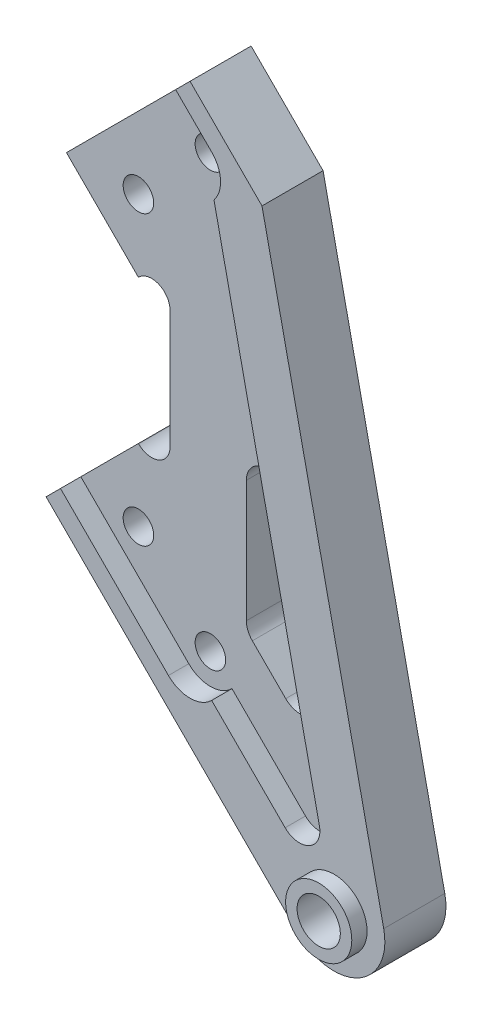
ISO-10303-21;
HEADER;
FILE_DESCRIPTION(('STEP AP214'),'2;1');
FILE_NAME('part.step','',(''),(''),'','','');
FILE_SCHEMA(('AUTOMOTIVE_DESIGN { 1 0 10303 214 1 1 1 1 }'));
ENDSEC;
DATA;
#1=APPLICATION_CONTEXT('core data for automotive mechanical design processes');
#2=APPLICATION_PROTOCOL_DEFINITION('international standard','automotive_design',2000,#1);
#3=PRODUCT_CONTEXT('',#1,'mechanical');
#4=PRODUCT('Part','Part','',(#3));
#5=PRODUCT_RELATED_PRODUCT_CATEGORY('part','',(#4));
#6=PRODUCT_DEFINITION_FORMATION('','',#4);
#7=PRODUCT_DEFINITION_CONTEXT('part definition',#1,'design');
#8=PRODUCT_DEFINITION('design','',#6,#7);
#9=PRODUCT_DEFINITION_SHAPE('','',#8);
#10=(LENGTH_UNIT() NAMED_UNIT(*) SI_UNIT(.MILLI.,.METRE.));
#11=(NAMED_UNIT(*) PLANE_ANGLE_UNIT() SI_UNIT($,.RADIAN.));
#12=(NAMED_UNIT(*) SI_UNIT($,.STERADIAN.) SOLID_ANGLE_UNIT());
#13=UNCERTAINTY_MEASURE_WITH_UNIT(LENGTH_MEASURE(1.E-05),#10,'distance_accuracy_value','');
#14=(GEOMETRIC_REPRESENTATION_CONTEXT(3) GLOBAL_UNCERTAINTY_ASSIGNED_CONTEXT((#13)) GLOBAL_UNIT_ASSIGNED_CONTEXT((#10,
#11,#12)) REPRESENTATION_CONTEXT('',''));
#15=CARTESIAN_POINT('',(0.,0.,0.));
#16=DIRECTION('',(0.,0.,1.));
#17=DIRECTION('',(1.,0.,0.));
#18=AXIS2_PLACEMENT_3D('',#15,#16,#17);
#19=CARTESIAN_POINT('',(27.2132034355966,-70.7106781186552,12.));
#20=DIRECTION('',(0.,0.,1.));
#21=DIRECTION('',(1.,0.,0.));
#22=AXIS2_PLACEMENT_3D('',#19,#20,#21);
#23=PLANE('',#22);
#24=CARTESIAN_POINT('',(27.2132034355966,-70.7106781186552,12.));
#25=DIRECTION('',(0.,0.,1.));
#26=DIRECTION('',(1.,0.,0.));
#27=AXIS2_PLACEMENT_3D('',#24,#25,#26);
#28=CIRCLE('',#27,9.99999999999997);
#29=CARTESIAN_POINT('',(20.1421356237311,-77.7817459305206,12.));
#30=VERTEX_POINT('',#29);
#31=CARTESIAN_POINT('',(36.9889583333888,-68.6048252799479,12.));
#32=VERTEX_POINT('',#31);
#33=EDGE_CURVE('E211',#30,#32,#28,.T.);
#34=ORIENTED_EDGE('',*,*,#33,.T.);
#35=DIRECTION('',(-0.210585283870724,0.977575489779222,0.));
#36=VECTOR('',#35,1.);
#37=CARTESIAN_POINT('',(36.9889583333888,-68.6048252799479,12.));
#38=LINE('',#37,#36);
#39=CARTESIAN_POINT('',(13.0710678118652,42.4264068711929,12.));
#40=VERTEX_POINT('',#39);
#41=EDGE_CURVE('E220',#32,#40,#38,.T.);
#42=ORIENTED_EDGE('',*,*,#41,.T.);
#43=DIRECTION('',(-0.707106781186546,0.707106781186548,0.));
#44=VECTOR('',#43,1.);
#45=CARTESIAN_POINT('',(13.0710678118652,42.4264068711929,12.));
#46=LINE('',#45,#44);
#47=CARTESIAN_POINT('',(-1.07106781186576,56.5685424949239,12.));
#48=VERTEX_POINT('',#47);
#49=EDGE_CURVE('E226',#40,#48,#46,.T.);
#50=ORIENTED_EDGE('',*,*,#49,.T.);
#51=DIRECTION('',(-0.707106781186547,-0.707106781186548,0.));
#52=VECTOR('',#51,1.);
#53=CARTESIAN_POINT('',(-3.8994949366121,53.7401153701776,12.));
#54=LINE('',#53,#52);
#55=CARTESIAN_POINT('',(-3.8994949366121,53.7401153701776,12.));
#56=VERTEX_POINT('',#55);
#57=EDGE_CURVE('E240',#48,#56,#54,.T.);
#58=ORIENTED_EDGE('',*,*,#57,.T.);
#59=DIRECTION('',(0.707106781186548,-0.707106781186547,0.));
#60=VECTOR('',#59,1.);
#61=CARTESIAN_POINT('',(3.17157287525336,46.6690475583121,12.));
#62=LINE('',#61,#60);
#63=CARTESIAN_POINT('',(3.17157287525336,46.6690475583121,12.));
#64=VERTEX_POINT('',#63);
#65=EDGE_CURVE('E242',#56,#64,#62,.T.);
#66=ORIENTED_EDGE('',*,*,#65,.T.);
#67=CARTESIAN_POINT('',(-1.07106781186593,42.4264068711928,12.));
#68=DIRECTION('',(0.,0.,-1.));
#69=DIRECTION('',(1.,0.,0.));
#70=AXIS2_PLACEMENT_3D('',#67,#68,#69);
#71=CIRCLE('',#70,6.);
#72=CARTESIAN_POINT('',(3.64163562151779,38.7128605406654,12.));
#73=VERTEX_POINT('',#72);
#74=EDGE_CURVE('E244',#64,#73,#71,.T.);
#75=ORIENTED_EDGE('',*,*,#74,.T.);
#76=DIRECTION('',(0.210585283870724,-0.977575489779222,0.));
#77=VECTOR('',#76,1.);
#78=CARTESIAN_POINT('',(24.3551656976039,-57.4431430365704,12.));
#79=LINE('',#78,#77);
#80=CARTESIAN_POINT('',(24.3551656976039,-57.4431430365704,12.));
#81=VERTEX_POINT('',#80);
#82=EDGE_CURVE('E246',#73,#81,#79,.T.);
#83=ORIENTED_EDGE('',*,*,#82,.T.);
#84=CARTESIAN_POINT('',(20.444863738487,-58.2854841720533,12.));
#85=DIRECTION('',(0.,0.,-1.));
#86=DIRECTION('',(-1.,0.,0.));
#87=AXIS2_PLACEMENT_3D('',#84,#85,#86);
#88=CIRCLE('',#87,4.);
#89=CARTESIAN_POINT('',(17.6164366137409,-61.1139112967994,12.));
#90=VERTEX_POINT('',#89);
#91=EDGE_CURVE('E248',#81,#90,#88,.T.);
#92=ORIENTED_EDGE('',*,*,#91,.T.);
#93=DIRECTION('',(-0.707106781186551,0.707106781186544,0.));
#94=VECTOR('',#93,1.);
#95=CARTESIAN_POINT('',(17.6164366137409,-61.1139112967994,12.));
#96=LINE('',#95,#94);
#97=CARTESIAN_POINT('',(3.1715728752534,-46.6690475583121,12.));
#98=VERTEX_POINT('',#97);
#99=EDGE_CURVE('E250',#90,#98,#96,.T.);
#100=ORIENTED_EDGE('',*,*,#99,.T.);
#101=CARTESIAN_POINT('',(-1.07106781186584,-42.4264068711928,12.));
#102=DIRECTION('',(0.,0.,-1.));
#103=DIRECTION('',(1.,0.,0.));
#104=AXIS2_PLACEMENT_3D('',#101,#102,#103);
#105=CIRCLE('',#104,6.);
#106=CARTESIAN_POINT('',(-5.31370849898513,-46.6690475583121,12.));
#107=VERTEX_POINT('',#106);
#108=EDGE_CURVE('E252',#98,#107,#105,.T.);
#109=ORIENTED_EDGE('',*,*,#108,.T.);
#110=DIRECTION('',(-0.707106781186548,0.707106781186547,0.));
#111=VECTOR('',#110,1.);
#112=CARTESIAN_POINT('',(-26.5269119345811,-25.4558441227161,12.));
#113=LINE('',#112,#111);
#114=CARTESIAN_POINT('',(-26.5269119345811,-25.4558441227161,12.));
#115=VERTEX_POINT('',#114);
#116=EDGE_CURVE('E254',#107,#115,#113,.T.);
#117=ORIENTED_EDGE('',*,*,#116,.T.);
#118=DIRECTION('',(-0.707106781186549,-0.707106781186546,0.));
#119=VECTOR('',#118,1.);
#120=CARTESIAN_POINT('',(-29.3553390593273,-28.2842712474624,12.));
#121=LINE('',#120,#119);
#122=CARTESIAN_POINT('',(-29.3553390593273,-28.2842712474624,12.));
#123=VERTEX_POINT('',#122);
#124=EDGE_CURVE('E256',#115,#123,#121,.T.);
#125=ORIENTED_EDGE('',*,*,#124,.T.);
#126=DIRECTION('',(0.707106781186549,-0.707106781186547,0.));
#127=VECTOR('',#126,1.);
#128=CARTESIAN_POINT('',(-29.3553390593273,-28.2842712474624,12.));
#129=LINE('',#128,#127);
#130=EDGE_CURVE('E232',#123,#30,#129,.T.);
#131=ORIENTED_EDGE('',*,*,#130,.T.);
#132=EDGE_LOOP('',(#34,#42,#50,#58,#66,#75,#83,#92,#100,#109,#117,#125,#131));
#133=FACE_BOUND('',#132,.T.);
#134=CARTESIAN_POINT('',(27.2132034355966,-70.7106781186552,12.));
#135=DIRECTION('',(0.,0.,1.));
#136=DIRECTION('',(1.,0.,0.));
#137=AXIS2_PLACEMENT_3D('',#134,#135,#136);
#138=CIRCLE('',#137,6.50000000000001);
#139=CARTESIAN_POINT('',(33.7132034355966,-70.7106781186552,12.));
#140=VERTEX_POINT('',#139);
#141=EDGE_CURVE('E236',#140,#140,#138,.T.);
#142=ORIENTED_EDGE('',*,*,#141,.F.);
#143=EDGE_LOOP('',(#142));
#144=FACE_BOUND('',#143,.T.);
#145=ADVANCED_FACE('F33',(#133,#144),#23,.T.);
#146=CARTESIAN_POINT('',(-12.6152236891495,11.6274169979712,8.));
#147=DIRECTION('',(0.,0.,1.));
#148=DIRECTION('',(1.,0.,0.));
#149=AXIS2_PLACEMENT_3D('',#146,#147,#148);
#150=PLANE('',#149);
#151=DIRECTION('',(-0.707106781186548,0.707106781186547,0.));
#152=VECTOR('',#151,1.);
#153=CARTESIAN_POINT('',(-26.5269119345811,-25.4558441227161,8.));
#154=LINE('',#153,#152);
#155=CARTESIAN_POINT('',(-5.31370849898513,-46.6690475583121,8.));
#156=VERTEX_POINT('',#155);
#157=CARTESIAN_POINT('',(-26.5269119345811,-25.4558441227161,8.));
#158=VERTEX_POINT('',#157);
#159=EDGE_CURVE('E50',#156,#158,#154,.T.);
#160=ORIENTED_EDGE('',*,*,#159,.F.);
#161=CARTESIAN_POINT('',(-1.07106781186584,-42.4264068711928,8.));
#162=DIRECTION('',(0.,0.,-1.));
#163=DIRECTION('',(1.,0.,0.));
#164=AXIS2_PLACEMENT_3D('',#161,#162,#163);
#165=CIRCLE('',#164,6.);
#166=CARTESIAN_POINT('',(3.1715728752534,-46.6690475583121,8.));
#167=VERTEX_POINT('',#166);
#168=EDGE_CURVE('E54',#167,#156,#165,.T.);
#169=ORIENTED_EDGE('',*,*,#168,.F.);
#170=DIRECTION('',(-0.707106781186551,0.707106781186544,0.));
#171=VECTOR('',#170,1.);
#172=CARTESIAN_POINT('',(17.6164366137409,-61.1139112967994,8.));
#173=LINE('',#172,#171);
#174=CARTESIAN_POINT('',(17.6164366137409,-61.1139112967994,8.));
#175=VERTEX_POINT('',#174);
#176=EDGE_CURVE('E268',#175,#167,#173,.T.);
#177=ORIENTED_EDGE('',*,*,#176,.F.);
#178=CARTESIAN_POINT('',(20.444863738487,-58.2854841720533,8.));
#179=DIRECTION('',(0.,0.,-1.));
#180=DIRECTION('',(-1.,0.,0.));
#181=AXIS2_PLACEMENT_3D('',#178,#179,#180);
#182=CIRCLE('',#181,4.);
#183=CARTESIAN_POINT('',(24.3551656976039,-57.4431430365704,8.));
#184=VERTEX_POINT('',#183);
#185=EDGE_CURVE('E265',#184,#175,#182,.T.);
#186=ORIENTED_EDGE('',*,*,#185,.F.);
#187=DIRECTION('',(0.210585283870724,-0.977575489779222,0.));
#188=VECTOR('',#187,1.);
#189=CARTESIAN_POINT('',(24.3551656976039,-57.4431430365704,8.));
#190=LINE('',#189,#188);
#191=CARTESIAN_POINT('',(20.4722925892908,-39.4181343045263,8.));
#192=VERTEX_POINT('',#191);
#193=EDGE_CURVE('E11',#192,#184,#190,.T.);
#194=ORIENTED_EDGE('',*,*,#193,.F.);
#195=CARTESIAN_POINT('',(16.5619906301739,-40.2604754400092,8.));
#196=DIRECTION('',(0.,0.,1.));
#197=DIRECTION('',(1.,0.,0.));
#198=AXIS2_PLACEMENT_3D('',#195,#196,#197);
#199=CIRCLE('',#198,4.00000000000001);
#200=CARTESIAN_POINT('',(13.7335635054277,-43.0889025647554,8.));
#201=VERTEX_POINT('',#200);
#202=EDGE_CURVE('E284',#201,#192,#199,.T.);
#203=ORIENTED_EDGE('',*,*,#202,.F.);
#204=DIRECTION('',(0.707106781186547,-0.707106781186548,0.));
#205=VECTOR('',#204,1.);
#206=CARTESIAN_POINT('',(7.17157287525357,-36.5269119345813,8.));
#207=LINE('',#206,#205);
#208=CARTESIAN_POINT('',(7.17157287525357,-36.5269119345813,8.));
#209=VERTEX_POINT('',#208);
#210=EDGE_CURVE('E311',#209,#201,#207,.T.);
#211=ORIENTED_EDGE('',*,*,#210,.F.);
#212=CARTESIAN_POINT('',(9.99999999999976,-33.6984848098351,8.));
#213=DIRECTION('',(0.,0.,1.));
#214=DIRECTION('',(1.,0.,0.));
#215=AXIS2_PLACEMENT_3D('',#212,#213,#214);
#216=CIRCLE('',#215,4.);
#217=CARTESIAN_POINT('',(5.99999999999976,-33.6984848098351,8.));
#218=VERTEX_POINT('',#217);
#219=EDGE_CURVE('E307',#218,#209,#216,.T.);
#220=ORIENTED_EDGE('',*,*,#219,.F.);
#221=DIRECTION('',(0.,-1.,0.));
#222=VECTOR('',#221,1.);
#223=CARTESIAN_POINT('',(5.99999999999972,-9.79851206674139,8.));
#224=LINE('',#223,#222);
#225=CARTESIAN_POINT('',(5.99999999999972,-9.79851206674139,8.));
#226=VERTEX_POINT('',#225);
#227=EDGE_CURVE('E305',#226,#218,#224,.T.);
#228=ORIENTED_EDGE('',*,*,#227,.F.);
#229=CARTESIAN_POINT('',(9.99999999999972,-9.79851206674138,8.));
#230=DIRECTION('',(0.,0.,1.));
#231=DIRECTION('',(-1.,0.,0.));
#232=AXIS2_PLACEMENT_3D('',#229,#230,#231);
#233=CIRCLE('',#232,4.);
#234=CARTESIAN_POINT('',(13.9103019591166,-8.95617093125849,8.));
#235=VERTEX_POINT('',#234);
#236=EDGE_CURVE('E308',#235,#226,#233,.T.);
#237=ORIENTED_EDGE('',*,*,#236,.F.);
#238=CARTESIAN_POINT('',(3.64163562151779,38.7128605406654,8.));
#239=VERTEX_POINT('',#238);
#240=EDGE_CURVE('E263',#239,#235,#190,.T.);
#241=ORIENTED_EDGE('',*,*,#240,.F.);
#242=CARTESIAN_POINT('',(-1.07106781186593,42.4264068711928,8.));
#243=DIRECTION('',(0.,0.,-1.));
#244=DIRECTION('',(1.,0.,0.));
#245=AXIS2_PLACEMENT_3D('',#242,#243,#244);
#246=CIRCLE('',#245,6.);
#247=CARTESIAN_POINT('',(3.17157287525336,46.6690475583121,8.));
#248=VERTEX_POINT('',#247);
#249=EDGE_CURVE('E260',#248,#239,#246,.T.);
#250=ORIENTED_EDGE('',*,*,#249,.F.);
#251=DIRECTION('',(0.707106781186548,-0.707106781186547,0.));
#252=VECTOR('',#251,1.);
#253=CARTESIAN_POINT('',(3.17157287525336,46.6690475583121,8.));
#254=LINE('',#253,#252);
#255=CARTESIAN_POINT('',(-3.8994949366121,53.7401153701776,8.));
#256=VERTEX_POINT('',#255);
#257=EDGE_CURVE('E264',#256,#248,#254,.T.);
#258=ORIENTED_EDGE('',*,*,#257,.F.);
#259=DIRECTION('',(-0.707106781186548,-0.707106781186547,0.));
#260=VECTOR('',#259,1.);
#261=CARTESIAN_POINT('',(-1.07106781186576,56.5685424949239,8.));
#262=LINE('',#261,#260);
#263=CARTESIAN_POINT('',(-29.3553390593277,28.284271247462,8.));
#264=VERTEX_POINT('',#263);
#265=EDGE_CURVE('E289',#256,#264,#262,.T.);
#266=ORIENTED_EDGE('',*,*,#265,.T.);
#267=DIRECTION('',(0.707106781186547,-0.707106781186548,0.));
#268=VECTOR('',#267,1.);
#269=CARTESIAN_POINT('',(-29.3553390593277,28.284271247462,8.));
#270=LINE('',#269,#268);
#271=CARTESIAN_POINT('',(-15.2132034355968,14.1421356237311,8.));
#272=VERTEX_POINT('',#271);
#273=EDGE_CURVE('E366',#264,#272,#270,.T.);
#274=ORIENTED_EDGE('',*,*,#273,.T.);
#275=DIRECTION('',(0.707106781186636,0.707106781186459,0.));
#276=VECTOR('',#275,1.);
#277=CARTESIAN_POINT('',(-15.2132034355968,14.1421356237311,8.));
#278=LINE('',#277,#276);
#279=CARTESIAN_POINT('',(-15.1715728752531,14.1837661840748,8.));
#280=VERTEX_POINT('',#279);
#281=EDGE_CURVE('E369',#272,#280,#278,.T.);
#282=ORIENTED_EDGE('',*,*,#281,.T.);
#283=CARTESIAN_POINT('',(-12.6152236891495,11.6274169979712,8.));
#284=DIRECTION('',(0.,0.,-1.));
#285=DIRECTION('',(1.,0.,0.));
#286=AXIS2_PLACEMENT_3D('',#283,#284,#285);
#287=CIRCLE('',#286,3.61522368914915);
#288=CARTESIAN_POINT('',(-9.00000000000033,11.6274169979712,8.));
#289=VERTEX_POINT('',#288);
#290=EDGE_CURVE('E372',#280,#289,#287,.T.);
#291=ORIENTED_EDGE('',*,*,#290,.T.);
#292=DIRECTION('',(0.,-1.,0.));
#293=VECTOR('',#292,1.);
#294=CARTESIAN_POINT('',(-9.00000000000031,11.6274169979712,8.));
#295=LINE('',#294,#293);
#296=CARTESIAN_POINT('',(-9.00000000000028,-11.6274169979711,8.));
#297=VERTEX_POINT('',#296);
#298=EDGE_CURVE('E374',#289,#297,#295,.T.);
#299=ORIENTED_EDGE('',*,*,#298,.T.);
#300=CARTESIAN_POINT('',(-12.6152236891495,-11.6274169979711,8.));
#301=DIRECTION('',(0.,0.,-1.));
#302=DIRECTION('',(-1.,0.,0.));
#303=AXIS2_PLACEMENT_3D('',#300,#301,#302);
#304=CIRCLE('',#303,3.61522368914917);
#305=CARTESIAN_POINT('',(-15.1715728752532,-14.1837661840747,8.));
#306=VERTEX_POINT('',#305);
#307=EDGE_CURVE('E376',#297,#306,#304,.T.);
#308=ORIENTED_EDGE('',*,*,#307,.T.);
#309=DIRECTION('',(-0.707106781186577,0.707106781186518,0.));
#310=VECTOR('',#309,1.);
#311=CARTESIAN_POINT('',(-15.2132034355964,-14.1421356237314,8.));
#312=LINE('',#311,#310);
#313=CARTESIAN_POINT('',(-15.2132034355964,-14.1421356237314,8.));
#314=VERTEX_POINT('',#313);
#315=EDGE_CURVE('E378',#306,#314,#312,.T.);
#316=ORIENTED_EDGE('',*,*,#315,.T.);
#317=DIRECTION('',(-0.707106781186548,-0.707106781186547,0.));
#318=VECTOR('',#317,1.);
#319=CARTESIAN_POINT('',(-29.3553390593273,-28.2842712474624,8.));
#320=LINE('',#319,#318);
#321=EDGE_CURVE('E380',#314,#158,#320,.T.);
#322=ORIENTED_EDGE('',*,*,#321,.T.);
#323=EDGE_LOOP('',(#160,#169,#177,#186,#194,#203,#211,#220,#228,#237,#241,#250,#258,#266,#274,
#282,#291,#299,#308,#316,#322));
#324=FACE_BOUND('',#323,.T.);
#325=CARTESIAN_POINT('',(-15.2132034355964,-28.2842712474622,8.));
#326=DIRECTION('',(0.,0.,1.));
#327=DIRECTION('',(1.,0.,0.));
#328=AXIS2_PLACEMENT_3D('',#325,#326,#327);
#329=CIRCLE('',#328,2.9999999999999);
#330=CARTESIAN_POINT('',(-12.2132034355965,-28.2842712474622,8.));
#331=VERTEX_POINT('',#330);
#332=EDGE_CURVE('E348',#331,#331,#329,.T.);
#333=ORIENTED_EDGE('',*,*,#332,.F.);
#334=EDGE_LOOP('',(#333));
#335=FACE_BOUND('',#334,.T.);
#336=CARTESIAN_POINT('',(-1.07106781186593,42.4264068711928,8.));
#337=DIRECTION('',(0.,0.,1.));
#338=DIRECTION('',(1.,0.,0.));
#339=AXIS2_PLACEMENT_3D('',#336,#337,#338);
#340=CIRCLE('',#339,3.);
#341=CARTESIAN_POINT('',(1.92893218813407,42.4264068711928,8.));
#342=VERTEX_POINT('',#341);
#343=EDGE_CURVE('E360',#342,#342,#340,.T.);
#344=ORIENTED_EDGE('',*,*,#343,.F.);
#345=EDGE_LOOP('',(#344));
#346=FACE_BOUND('',#345,.T.);
#347=CARTESIAN_POINT('',(-15.2132034355965,28.2842712474622,8.));
#348=DIRECTION('',(0.,0.,1.));
#349=DIRECTION('',(1.,0.,0.));
#350=AXIS2_PLACEMENT_3D('',#347,#348,#349);
#351=CIRCLE('',#350,3.);
#352=CARTESIAN_POINT('',(-12.2132034355965,28.2842712474622,8.));
#353=VERTEX_POINT('',#352);
#354=EDGE_CURVE('E354',#353,#353,#351,.T.);
#355=ORIENTED_EDGE('',*,*,#354,.F.);
#356=EDGE_LOOP('',(#355));
#357=FACE_BOUND('',#356,.T.);
#358=CARTESIAN_POINT('',(-1.07106781186585,-42.4264068711928,8.));
#359=DIRECTION('',(0.,0.,1.));
#360=DIRECTION('',(1.,0.,0.));
#361=AXIS2_PLACEMENT_3D('',#358,#359,#360);
#362=CIRCLE('',#361,2.99999999999988);
#363=CARTESIAN_POINT('',(1.92893218813403,-42.4264068711928,8.));
#364=VERTEX_POINT('',#363);
#365=EDGE_CURVE('E340',#364,#364,#362,.T.);
#366=ORIENTED_EDGE('',*,*,#365,.F.);
#367=EDGE_LOOP('',(#366));
#368=FACE_BOUND('',#367,.T.);
#369=ADVANCED_FACE('F449',(#324,#335,#346,#357,#368),#150,.T.);
#370=CARTESIAN_POINT('',(-12.6152236891495,11.6274169979712,0.));
#371=DIRECTION('',(0.,0.,1.));
#372=DIRECTION('',(1.,0.,0.));
#373=AXIS2_PLACEMENT_3D('',#370,#371,#372);
#374=PLANE('',#373);
#375=CARTESIAN_POINT('',(16.5619906301739,-40.2604754400092,0.));
#376=DIRECTION('',(0.,0.,1.));
#377=DIRECTION('',(1.,0.,0.));
#378=AXIS2_PLACEMENT_3D('',#375,#376,#377);
#379=CIRCLE('',#378,4.00000000000001);
#380=CARTESIAN_POINT('',(13.7335635054277,-43.0889025647554,0.));
#381=VERTEX_POINT('',#380);
#382=CARTESIAN_POINT('',(20.4722925892908,-39.4181343045263,0.));
#383=VERTEX_POINT('',#382);
#384=EDGE_CURVE('E303',#381,#383,#379,.T.);
#385=ORIENTED_EDGE('',*,*,#384,.T.);
#386=DIRECTION('',(-0.210585283870724,0.977575489779222,0.));
#387=VECTOR('',#386,1.);
#388=CARTESIAN_POINT('',(20.4722925892908,-39.4181343045263,0.));
#389=LINE('',#388,#387);
#390=CARTESIAN_POINT('',(13.9103019591166,-8.95617093125849,0.));
#391=VERTEX_POINT('',#390);
#392=EDGE_CURVE('E316',#383,#391,#389,.T.);
#393=ORIENTED_EDGE('',*,*,#392,.T.);
#394=CARTESIAN_POINT('',(9.99999999999972,-9.79851206674138,0.));
#395=DIRECTION('',(0.,0.,1.));
#396=DIRECTION('',(-1.,0.,0.));
#397=AXIS2_PLACEMENT_3D('',#394,#395,#396);
#398=CIRCLE('',#397,4.);
#399=CARTESIAN_POINT('',(5.99999999999972,-9.79851206674139,0.));
#400=VERTEX_POINT('',#399);
#401=EDGE_CURVE('E319',#391,#400,#398,.T.);
#402=ORIENTED_EDGE('',*,*,#401,.T.);
#403=DIRECTION('',(0.,-1.,0.));
#404=VECTOR('',#403,1.);
#405=CARTESIAN_POINT('',(5.99999999999972,-9.79851206674139,0.));
#406=LINE('',#405,#404);
#407=CARTESIAN_POINT('',(5.99999999999976,-33.6984848098351,0.));
#408=VERTEX_POINT('',#407);
#409=EDGE_CURVE('E322',#400,#408,#406,.T.);
#410=ORIENTED_EDGE('',*,*,#409,.T.);
#411=CARTESIAN_POINT('',(9.99999999999976,-33.6984848098351,0.));
#412=DIRECTION('',(0.,0.,1.));
#413=DIRECTION('',(1.,0.,0.));
#414=AXIS2_PLACEMENT_3D('',#411,#412,#413);
#415=CIRCLE('',#414,4.);
#416=CARTESIAN_POINT('',(7.17157287525357,-36.5269119345813,0.));
#417=VERTEX_POINT('',#416);
#418=EDGE_CURVE('E325',#408,#417,#415,.T.);
#419=ORIENTED_EDGE('',*,*,#418,.T.);
#420=DIRECTION('',(0.707106781186547,-0.707106781186548,0.));
#421=VECTOR('',#420,1.);
#422=CARTESIAN_POINT('',(7.17157287525357,-36.5269119345813,0.));
#423=LINE('',#422,#421);
#424=EDGE_CURVE('E328',#417,#381,#423,.T.);
#425=ORIENTED_EDGE('',*,*,#424,.T.);
#426=EDGE_LOOP('',(#385,#393,#402,#410,#419,#425));
#427=FACE_BOUND('',#426,.T.);
#428=CARTESIAN_POINT('',(-15.2132034355964,-28.2842712474622,0.));
#429=DIRECTION('',(0.,0.,1.));
#430=DIRECTION('',(1.,0.,0.));
#431=AXIS2_PLACEMENT_3D('',#428,#429,#430);
#432=CIRCLE('',#431,2.9999999999999);
#433=CARTESIAN_POINT('',(-12.2132034355965,-28.2842712474622,0.));
#434=VERTEX_POINT('',#433);
#435=EDGE_CURVE('E343',#434,#434,#432,.T.);
#436=ORIENTED_EDGE('',*,*,#435,.T.);
#437=EDGE_LOOP('',(#436));
#438=FACE_BOUND('',#437,.T.);
#439=CARTESIAN_POINT('',(-1.07106781186593,42.4264068711928,0.));
#440=DIRECTION('',(0.,0.,1.));
#441=DIRECTION('',(1.,0.,0.));
#442=AXIS2_PLACEMENT_3D('',#439,#440,#441);
#443=CIRCLE('',#442,3.);
#444=CARTESIAN_POINT('',(1.92893218813407,42.4264068711928,0.));
#445=VERTEX_POINT('',#444);
#446=EDGE_CURVE('E357',#445,#445,#443,.T.);
#447=ORIENTED_EDGE('',*,*,#446,.T.);
#448=EDGE_LOOP('',(#447));
#449=FACE_BOUND('',#448,.T.);
#450=DIRECTION('',(0.707106781186547,-0.707106781186548,0.));
#451=VECTOR('',#450,1.);
#452=CARTESIAN_POINT('',(-29.3553390593277,28.284271247462,0.));
#453=LINE('',#452,#451);
#454=CARTESIAN_POINT('',(-29.3553390593277,28.284271247462,0.));
#455=VERTEX_POINT('',#454);
#456=CARTESIAN_POINT('',(-15.2132034355968,14.1421356237311,0.));
#457=VERTEX_POINT('',#456);
#458=EDGE_CURVE('E363',#455,#457,#453,.T.);
#459=ORIENTED_EDGE('',*,*,#458,.F.);
#460=DIRECTION('',(-0.707106781186548,-0.707106781186547,0.));
#461=VECTOR('',#460,1.);
#462=CARTESIAN_POINT('',(-1.07106781186576,56.5685424949239,0.));
#463=LINE('',#462,#461);
#464=CARTESIAN_POINT('',(-1.07106781186576,56.5685424949239,0.));
#465=VERTEX_POINT('',#464);
#466=EDGE_CURVE('E370',#465,#455,#463,.T.);
#467=ORIENTED_EDGE('',*,*,#466,.F.);
#468=DIRECTION('',(-0.707106781186546,0.707106781186548,0.));
#469=VECTOR('',#468,1.);
#470=CARTESIAN_POINT('',(13.0710678118652,42.4264068711929,0.));
#471=LINE('',#470,#469);
#472=CARTESIAN_POINT('',(13.0710678118652,42.4264068711929,0.));
#473=VERTEX_POINT('',#472);
#474=EDGE_CURVE('E414',#473,#465,#471,.T.);
#475=ORIENTED_EDGE('',*,*,#474,.F.);
#476=DIRECTION('',(-0.210585283870724,0.977575489779222,0.));
#477=VECTOR('',#476,1.);
#478=CARTESIAN_POINT('',(36.9889583333888,-68.6048252799479,0.));
#479=LINE('',#478,#477);
#480=CARTESIAN_POINT('',(36.9889583333888,-68.6048252799479,0.));
#481=VERTEX_POINT('',#480);
#482=EDGE_CURVE('E416',#481,#473,#479,.T.);
#483=ORIENTED_EDGE('',*,*,#482,.F.);
#484=CARTESIAN_POINT('',(27.2132034355966,-70.7106781186552,0.));
#485=DIRECTION('',(0.,0.,1.));
#486=DIRECTION('',(1.,0.,0.));
#487=AXIS2_PLACEMENT_3D('',#484,#485,#486);
#488=CIRCLE('',#487,9.99999999999996);
#489=CARTESIAN_POINT('',(20.1421356237311,-77.7817459305206,0.));
#490=VERTEX_POINT('',#489);
#491=EDGE_CURVE('E213',#490,#481,#488,.T.);
#492=ORIENTED_EDGE('',*,*,#491,.F.);
#493=DIRECTION('',(0.707106781186549,-0.707106781186547,0.));
#494=VECTOR('',#493,1.);
#495=CARTESIAN_POINT('',(20.1421356237311,-77.7817459305206,0.));
#496=LINE('',#495,#494);
#497=CARTESIAN_POINT('',(-29.3553390593273,-28.2842712474624,0.));
#498=VERTEX_POINT('',#497);
#499=EDGE_CURVE('E419',#498,#490,#496,.T.);
#500=ORIENTED_EDGE('',*,*,#499,.F.);
#501=DIRECTION('',(-0.707106781186548,-0.707106781186547,0.));
#502=VECTOR('',#501,1.);
#503=CARTESIAN_POINT('',(-29.3553390593273,-28.2842712474624,0.));
#504=LINE('',#503,#502);
#505=CARTESIAN_POINT('',(-15.2132034355964,-14.1421356237314,0.));
#506=VERTEX_POINT('',#505);
#507=EDGE_CURVE('E421',#506,#498,#504,.T.);
#508=ORIENTED_EDGE('',*,*,#507,.F.);
#509=DIRECTION('',(-0.707106781186577,0.707106781186518,0.));
#510=VECTOR('',#509,1.);
#511=CARTESIAN_POINT('',(-15.2132034355964,-14.1421356237314,0.));
#512=LINE('',#511,#510);
#513=CARTESIAN_POINT('',(-15.1715728752532,-14.1837661840747,0.));
#514=VERTEX_POINT('',#513);
#515=EDGE_CURVE('E423',#514,#506,#512,.T.);
#516=ORIENTED_EDGE('',*,*,#515,.F.);
#517=CARTESIAN_POINT('',(-12.6152236891495,-11.6274169979711,0.));
#518=DIRECTION('',(0.,0.,-1.));
#519=DIRECTION('',(-1.,0.,0.));
#520=AXIS2_PLACEMENT_3D('',#517,#518,#519);
#521=CIRCLE('',#520,3.61522368914917);
#522=CARTESIAN_POINT('',(-9.00000000000028,-11.6274169979711,0.));
#523=VERTEX_POINT('',#522);
#524=EDGE_CURVE('E425',#523,#514,#521,.T.);
#525=ORIENTED_EDGE('',*,*,#524,.F.);
#526=DIRECTION('',(0.,-1.,0.));
#527=VECTOR('',#526,1.);
#528=CARTESIAN_POINT('',(-9.00000000000031,11.6274169979712,0.));
#529=LINE('',#528,#527);
#530=CARTESIAN_POINT('',(-9.00000000000033,11.6274169979712,0.));
#531=VERTEX_POINT('',#530);
#532=EDGE_CURVE('E427',#531,#523,#529,.T.);
#533=ORIENTED_EDGE('',*,*,#532,.F.);
#534=CARTESIAN_POINT('',(-12.6152236891495,11.6274169979712,0.));
#535=DIRECTION('',(0.,0.,-1.));
#536=DIRECTION('',(1.,0.,0.));
#537=AXIS2_PLACEMENT_3D('',#534,#535,#536);
#538=CIRCLE('',#537,3.61522368914915);
#539=CARTESIAN_POINT('',(-15.1715728752531,14.1837661840748,0.));
#540=VERTEX_POINT('',#539);
#541=EDGE_CURVE('E429',#540,#531,#538,.T.);
#542=ORIENTED_EDGE('',*,*,#541,.F.);
#543=DIRECTION('',(0.707106781186636,0.707106781186459,0.));
#544=VECTOR('',#543,1.);
#545=CARTESIAN_POINT('',(-15.2132034355968,14.1421356237311,0.));
#546=LINE('',#545,#544);
#547=EDGE_CURVE('E431',#457,#540,#546,.T.);
#548=ORIENTED_EDGE('',*,*,#547,.F.);
#549=EDGE_LOOP('',(#459,#467,#475,#483,#492,#500,#508,#516,#525,#533,#542,#548));
#550=FACE_BOUND('',#549,.T.);
#551=CARTESIAN_POINT('',(-15.2132034355965,28.2842712474622,0.));
#552=DIRECTION('',(0.,0.,1.));
#553=DIRECTION('',(1.,0.,0.));
#554=AXIS2_PLACEMENT_3D('',#551,#552,#553);
#555=CIRCLE('',#554,3.);
#556=CARTESIAN_POINT('',(-12.2132034355965,28.2842712474622,0.));
#557=VERTEX_POINT('',#556);
#558=EDGE_CURVE('E351',#557,#557,#555,.T.);
#559=ORIENTED_EDGE('',*,*,#558,.T.);
#560=EDGE_LOOP('',(#559));
#561=FACE_BOUND('',#560,.T.);
#562=CARTESIAN_POINT('',(-1.07106781186585,-42.4264068711928,0.));
#563=DIRECTION('',(0.,0.,1.));
#564=DIRECTION('',(1.,0.,0.));
#565=AXIS2_PLACEMENT_3D('',#562,#563,#564);
#566=CIRCLE('',#565,2.99999999999988);
#567=CARTESIAN_POINT('',(1.92893218813403,-42.4264068711928,0.));
#568=VERTEX_POINT('',#567);
#569=EDGE_CURVE('E344',#568,#568,#566,.T.);
#570=ORIENTED_EDGE('',*,*,#569,.T.);
#571=EDGE_LOOP('',(#570));
#572=FACE_BOUND('',#571,.T.);
#573=CARTESIAN_POINT('',(27.2132034355966,-70.7106781186552,0.));
#574=DIRECTION('',(0.,0.,1.));
#575=DIRECTION('',(1.,0.,0.));
#576=AXIS2_PLACEMENT_3D('',#573,#574,#575);
#577=CIRCLE('',#576,4.25000000000001);
#578=CARTESIAN_POINT('',(31.4632034355966,-70.7106781186552,0.));
#579=VERTEX_POINT('',#578);
#580=EDGE_CURVE('E300',#579,#579,#577,.T.);
#581=ORIENTED_EDGE('',*,*,#580,.T.);
#582=EDGE_LOOP('',(#581));
#583=FACE_BOUND('',#582,.T.);
#584=ADVANCED_FACE('F440',(#427,#438,#449,#550,#561,#572,#583),#374,.F.);
#585=CARTESIAN_POINT('',(-29.3553390593277,28.284271247462,8.));
#586=DIRECTION('',(0.707106781186548,0.707106781186547,0.));
#587=DIRECTION('',(-0.707106781186547,0.707106781186548,0.));
#588=AXIS2_PLACEMENT_3D('',#585,#586,#587);
#589=PLANE('',#588);
#590=ORIENTED_EDGE('',*,*,#458,.T.);
#591=DIRECTION('',(0.,0.,-1.));
#592=VECTOR('',#591,1.);
#593=CARTESIAN_POINT('',(-15.2132034355968,14.1421356237311,8.));
#594=LINE('',#593,#592);
#595=EDGE_CURVE('E42',#272,#457,#594,.T.);
#596=ORIENTED_EDGE('',*,*,#595,.F.);
#597=ORIENTED_EDGE('',*,*,#273,.F.);
#598=DIRECTION('',(0.,0.,-1.));
#599=VECTOR('',#598,1.);
#600=CARTESIAN_POINT('',(-29.3553390593277,28.284271247462,8.));
#601=LINE('',#600,#599);
#602=EDGE_CURVE('E410',#264,#455,#601,.T.);
#603=ORIENTED_EDGE('',*,*,#602,.T.);
#604=EDGE_LOOP('',(#590,#596,#597,#603));
#605=FACE_BOUND('',#604,.T.);
#606=ADVANCED_FACE('F35',(#605),#589,.F.);
#607=CARTESIAN_POINT('',(-15.2132034355968,14.1421356237311,8.));
#608=DIRECTION('',(-0.707106781186459,0.707106781186636,0.));
#609=DIRECTION('',(-0.707106781186636,-0.707106781186459,0.));
#610=AXIS2_PLACEMENT_3D('',#607,#608,#609);
#611=PLANE('',#610);
#612=ORIENTED_EDGE('',*,*,#547,.T.);
#613=DIRECTION('',(0.,0.,-1.));
#614=VECTOR('',#613,1.);
#615=CARTESIAN_POINT('',(-15.1715728752531,14.1837661840748,8.));
#616=LINE('',#615,#614);
#617=EDGE_CURVE('E387',#280,#540,#616,.T.);
#618=ORIENTED_EDGE('',*,*,#617,.F.);
#619=ORIENTED_EDGE('',*,*,#281,.F.);
#620=ORIENTED_EDGE('',*,*,#595,.T.);
#621=EDGE_LOOP('',(#612,#618,#619,#620));
#622=FACE_BOUND('',#621,.T.);
#623=ADVANCED_FACE('F447',(#622),#611,.F.);
#624=CARTESIAN_POINT('',(-12.6152236891495,11.6274169979712,8.));
#625=DIRECTION('',(0.,0.,-1.));
#626=DIRECTION('',(-1.,0.,0.));
#627=AXIS2_PLACEMENT_3D('',#624,#625,#626);
#628=CYLINDRICAL_SURFACE('',#627,3.61522368914915);
#629=ORIENTED_EDGE('',*,*,#541,.T.);
#630=DIRECTION('',(0.,0.,-1.));
#631=VECTOR('',#630,1.);
#632=CARTESIAN_POINT('',(-9.00000000000033,11.6274169979712,8.));
#633=LINE('',#632,#631);
#634=EDGE_CURVE('E390',#289,#531,#633,.T.);
#635=ORIENTED_EDGE('',*,*,#634,.F.);
#636=ORIENTED_EDGE('',*,*,#290,.F.);
#637=ORIENTED_EDGE('',*,*,#617,.T.);
#638=EDGE_LOOP('',(#629,#635,#636,#637));
#639=FACE_BOUND('',#638,.T.);
#640=ADVANCED_FACE('F525',(#639),#628,.F.);
#641=CARTESIAN_POINT('',(-9.00000000000031,11.6274169979712,8.));
#642=DIRECTION('',(1.,0.,0.));
#643=DIRECTION('',(0.,1.,0.));
#644=AXIS2_PLACEMENT_3D('',#641,#642,#643);
#645=PLANE('',#644);
#646=ORIENTED_EDGE('',*,*,#532,.T.);
#647=DIRECTION('',(0.,0.,-1.));
#648=VECTOR('',#647,1.);
#649=CARTESIAN_POINT('',(-9.00000000000028,-11.6274169979711,8.));
#650=LINE('',#649,#648);
#651=EDGE_CURVE('E393',#297,#523,#650,.T.);
#652=ORIENTED_EDGE('',*,*,#651,.F.);
#653=ORIENTED_EDGE('',*,*,#298,.F.);
#654=ORIENTED_EDGE('',*,*,#634,.T.);
#655=EDGE_LOOP('',(#646,#652,#653,#654));
#656=FACE_BOUND('',#655,.T.);
#657=ADVANCED_FACE('F521',(#656),#645,.F.);
#658=CARTESIAN_POINT('',(-12.6152236891495,-11.6274169979711,8.));
#659=DIRECTION('',(0.,0.,-1.));
#660=DIRECTION('',(-1.,0.,0.));
#661=AXIS2_PLACEMENT_3D('',#658,#659,#660);
#662=CYLINDRICAL_SURFACE('',#661,3.61522368914917);
#663=ORIENTED_EDGE('',*,*,#524,.T.);
#664=DIRECTION('',(0.,0.,-1.));
#665=VECTOR('',#664,1.);
#666=CARTESIAN_POINT('',(-15.1715728752532,-14.1837661840747,8.));
#667=LINE('',#666,#665);
#668=EDGE_CURVE('E396',#306,#514,#667,.T.);
#669=ORIENTED_EDGE('',*,*,#668,.F.);
#670=ORIENTED_EDGE('',*,*,#307,.F.);
#671=ORIENTED_EDGE('',*,*,#651,.T.);
#672=EDGE_LOOP('',(#663,#669,#670,#671));
#673=FACE_BOUND('',#672,.T.);
#674=ADVANCED_FACE('F518',(#673),#662,.F.);
#675=CARTESIAN_POINT('',(-15.2132034355964,-14.1421356237314,8.));
#676=DIRECTION('',(-0.707106781186518,-0.707106781186577,0.));
#677=DIRECTION('',(0.707106781186577,-0.707106781186518,0.));
#678=AXIS2_PLACEMENT_3D('',#675,#676,#677);
#679=PLANE('',#678);
#680=ORIENTED_EDGE('',*,*,#515,.T.);
#681=DIRECTION('',(0.,0.,-1.));
#682=VECTOR('',#681,1.);
#683=CARTESIAN_POINT('',(-15.2132034355964,-14.1421356237314,8.));
#684=LINE('',#683,#682);
#685=EDGE_CURVE('E399',#314,#506,#684,.T.);
#686=ORIENTED_EDGE('',*,*,#685,.F.);
#687=ORIENTED_EDGE('',*,*,#315,.F.);
#688=ORIENTED_EDGE('',*,*,#668,.T.);
#689=EDGE_LOOP('',(#680,#686,#687,#688));
#690=FACE_BOUND('',#689,.T.);
#691=ADVANCED_FACE('F514',(#690),#679,.F.);
#692=CARTESIAN_POINT('',(-29.3553390593273,-28.2842712474624,8.));
#693=DIRECTION('',(0.707106781186547,-0.707106781186548,0.));
#694=DIRECTION('',(0.707106781186548,0.707106781186547,0.));
#695=AXIS2_PLACEMENT_3D('',#692,#693,#694);
#696=PLANE('',#695);
#697=ORIENTED_EDGE('',*,*,#507,.T.);
#698=DIRECTION('',(0.,0.,-1.));
#699=VECTOR('',#698,1.);
#700=CARTESIAN_POINT('',(-29.3553390593273,-28.2842712474624,8.));
#701=LINE('',#700,#699);
#702=EDGE_CURVE('E402',#123,#498,#701,.T.);
#703=ORIENTED_EDGE('',*,*,#702,.F.);
#704=ORIENTED_EDGE('',*,*,#124,.F.);
#705=DIRECTION('',(0.,0.,-1.));
#706=VECTOR('',#705,1.);
#707=CARTESIAN_POINT('',(-26.5269119345811,-25.4558441227161,12.));
#708=LINE('',#707,#706);
#709=EDGE_CURVE('E259',#115,#158,#708,.T.);
#710=ORIENTED_EDGE('',*,*,#709,.T.);
#711=ORIENTED_EDGE('',*,*,#321,.F.);
#712=ORIENTED_EDGE('',*,*,#685,.T.);
#713=EDGE_LOOP('',(#697,#703,#704,#710,#711,#712));
#714=FACE_BOUND('',#713,.T.);
#715=ADVANCED_FACE('F504',(#714),#696,.F.);
#716=CARTESIAN_POINT('',(20.1421356237311,-77.7817459305206,8.));
#717=DIRECTION('',(0.707106781186547,0.707106781186549,0.));
#718=DIRECTION('',(-0.707106781186549,0.707106781186547,0.));
#719=AXIS2_PLACEMENT_3D('',#716,#717,#718);
#720=PLANE('',#719);
#721=ORIENTED_EDGE('',*,*,#499,.T.);
#722=DIRECTION('',(0.,0.,-1.));
#723=VECTOR('',#722,1.);
#724=CARTESIAN_POINT('',(20.1421356237311,-77.7817459305206,8.));
#725=LINE('',#724,#723);
#726=EDGE_CURVE('E216',#30,#490,#725,.T.);
#727=ORIENTED_EDGE('',*,*,#726,.F.);
#728=ORIENTED_EDGE('',*,*,#130,.F.);
#729=ORIENTED_EDGE('',*,*,#702,.T.);
#730=EDGE_LOOP('',(#721,#727,#728,#729));
#731=FACE_BOUND('',#730,.T.);
#732=ADVANCED_FACE('F506',(#731),#720,.F.);
#733=CARTESIAN_POINT('',(27.2132034355966,-70.7106781186552,8.));
#734=DIRECTION('',(0.,0.,-1.));
#735=DIRECTION('',(-1.,0.,0.));
#736=AXIS2_PLACEMENT_3D('',#733,#734,#735);
#737=CYLINDRICAL_SURFACE('',#736,9.99999999999996);
#738=ORIENTED_EDGE('',*,*,#491,.T.);
#739=DIRECTION('',(0.,0.,-1.));
#740=VECTOR('',#739,1.);
#741=CARTESIAN_POINT('',(36.9889583333888,-68.6048252799479,8.));
#742=LINE('',#741,#740);
#743=EDGE_CURVE('E206',#32,#481,#742,.T.);
#744=ORIENTED_EDGE('',*,*,#743,.F.);
#745=ORIENTED_EDGE('',*,*,#33,.F.);
#746=ORIENTED_EDGE('',*,*,#726,.T.);
#747=EDGE_LOOP('',(#738,#744,#745,#746));
#748=FACE_BOUND('',#747,.T.);
#749=ADVANCED_FACE('F208',(#748),#737,.T.);
#750=CARTESIAN_POINT('',(36.9889583333888,-68.6048252799479,8.));
#751=DIRECTION('',(-0.977575489779222,-0.210585283870724,0.));
#752=DIRECTION('',(0.210585283870724,-0.977575489779222,0.));
#753=AXIS2_PLACEMENT_3D('',#750,#751,#752);
#754=PLANE('',#753);
#755=ORIENTED_EDGE('',*,*,#482,.T.);
#756=DIRECTION('',(0.,0.,-1.));
#757=VECTOR('',#756,1.);
#758=CARTESIAN_POINT('',(13.0710678118652,42.4264068711929,8.));
#759=LINE('',#758,#757);
#760=EDGE_CURVE('E217',#40,#473,#759,.T.);
#761=ORIENTED_EDGE('',*,*,#760,.F.);
#762=ORIENTED_EDGE('',*,*,#41,.F.);
#763=ORIENTED_EDGE('',*,*,#743,.T.);
#764=EDGE_LOOP('',(#755,#761,#762,#763));
#765=FACE_BOUND('',#764,.T.);
#766=ADVANCED_FACE('F221',(#765),#754,.F.);
#767=CARTESIAN_POINT('',(13.0710678118652,42.4264068711929,8.));
#768=DIRECTION('',(-0.707106781186549,-0.707106781186547,0.));
#769=DIRECTION('',(0.707106781186546,-0.707106781186549,0.));
#770=AXIS2_PLACEMENT_3D('',#767,#768,#769);
#771=PLANE('',#770);
#772=ORIENTED_EDGE('',*,*,#474,.T.);
#773=DIRECTION('',(0.,0.,-1.));
#774=VECTOR('',#773,1.);
#775=CARTESIAN_POINT('',(-1.07106781186576,56.5685424949239,8.));
#776=LINE('',#775,#774);
#777=EDGE_CURVE('E407',#48,#465,#776,.T.);
#778=ORIENTED_EDGE('',*,*,#777,.F.);
#779=ORIENTED_EDGE('',*,*,#49,.F.);
#780=ORIENTED_EDGE('',*,*,#760,.T.);
#781=EDGE_LOOP('',(#772,#778,#779,#780));
#782=FACE_BOUND('',#781,.T.);
#783=ADVANCED_FACE('F459',(#782),#771,.F.);
#784=CARTESIAN_POINT('',(-1.07106781186576,56.5685424949239,8.));
#785=DIRECTION('',(0.707106781186547,-0.707106781186549,0.));
#786=DIRECTION('',(0.707106781186549,0.707106781186547,0.));
#787=AXIS2_PLACEMENT_3D('',#784,#785,#786);
#788=PLANE('',#787);
#789=ORIENTED_EDGE('',*,*,#466,.T.);
#790=ORIENTED_EDGE('',*,*,#602,.F.);
#791=ORIENTED_EDGE('',*,*,#265,.F.);
#792=DIRECTION('',(0.,0.,-1.));
#793=VECTOR('',#792,1.);
#794=CARTESIAN_POINT('',(-3.8994949366121,53.7401153701776,12.));
#795=LINE('',#794,#793);
#796=EDGE_CURVE('E304',#56,#256,#795,.T.);
#797=ORIENTED_EDGE('',*,*,#796,.F.);
#798=ORIENTED_EDGE('',*,*,#57,.F.);
#799=ORIENTED_EDGE('',*,*,#777,.T.);
#800=EDGE_LOOP('',(#789,#790,#791,#797,#798,#799));
#801=FACE_BOUND('',#800,.T.);
#802=ADVANCED_FACE('F456',(#801),#788,.F.);
#803=CARTESIAN_POINT('',(-1.07106781186593,42.4264068711928,8.));
#804=DIRECTION('',(0.,0.,-1.));
#805=DIRECTION('',(-1.,0.,0.));
#806=AXIS2_PLACEMENT_3D('',#803,#804,#805);
#807=CYLINDRICAL_SURFACE('',#806,3.);
#808=ORIENTED_EDGE('',*,*,#343,.T.);
#809=EDGE_LOOP('',(#808));
#810=FACE_BOUND('',#809,.T.);
#811=ORIENTED_EDGE('',*,*,#446,.F.);
#812=EDGE_LOOP('',(#811));
#813=FACE_BOUND('',#812,.T.);
#814=ADVANCED_FACE('F595',(#810,#813),#807,.F.);
#815=CARTESIAN_POINT('',(-15.2132034355965,28.2842712474622,8.));
#816=DIRECTION('',(0.,0.,-1.));
#817=DIRECTION('',(-1.,0.,0.));
#818=AXIS2_PLACEMENT_3D('',#815,#816,#817);
#819=CYLINDRICAL_SURFACE('',#818,3.);
#820=ORIENTED_EDGE('',*,*,#354,.T.);
#821=EDGE_LOOP('',(#820));
#822=FACE_BOUND('',#821,.T.);
#823=ORIENTED_EDGE('',*,*,#558,.F.);
#824=EDGE_LOOP('',(#823));
#825=FACE_BOUND('',#824,.T.);
#826=ADVANCED_FACE('F591',(#822,#825),#819,.F.);
#827=CARTESIAN_POINT('',(-15.2132034355964,-28.2842712474622,8.));
#828=DIRECTION('',(0.,0.,-1.));
#829=DIRECTION('',(-1.,0.,0.));
#830=AXIS2_PLACEMENT_3D('',#827,#828,#829);
#831=CYLINDRICAL_SURFACE('',#830,2.9999999999999);
#832=ORIENTED_EDGE('',*,*,#332,.T.);
#833=EDGE_LOOP('',(#832));
#834=FACE_BOUND('',#833,.T.);
#835=ORIENTED_EDGE('',*,*,#435,.F.);
#836=EDGE_LOOP('',(#835));
#837=FACE_BOUND('',#836,.T.);
#838=ADVANCED_FACE('F587',(#834,#837),#831,.F.);
#839=CARTESIAN_POINT('',(-1.07106781186585,-42.4264068711928,8.));
#840=DIRECTION('',(0.,0.,-1.));
#841=DIRECTION('',(-1.,0.,0.));
#842=AXIS2_PLACEMENT_3D('',#839,#840,#841);
#843=CYLINDRICAL_SURFACE('',#842,2.99999999999988);
#844=ORIENTED_EDGE('',*,*,#365,.T.);
#845=EDGE_LOOP('',(#844));
#846=FACE_BOUND('',#845,.T.);
#847=ORIENTED_EDGE('',*,*,#569,.F.);
#848=EDGE_LOOP('',(#847));
#849=FACE_BOUND('',#848,.T.);
#850=ADVANCED_FACE('F583',(#846,#849),#843,.F.);
#851=CARTESIAN_POINT('',(16.5619906301739,-40.2604754400092,8.));
#852=DIRECTION('',(0.,0.,-1.));
#853=DIRECTION('',(-1.,0.,0.));
#854=AXIS2_PLACEMENT_3D('',#851,#852,#853);
#855=CYLINDRICAL_SURFACE('',#854,4.00000000000001);
#856=ORIENTED_EDGE('',*,*,#384,.F.);
#857=DIRECTION('',(0.,0.,-1.));
#858=VECTOR('',#857,1.);
#859=CARTESIAN_POINT('',(13.7335635054277,-43.0889025647554,8.));
#860=LINE('',#859,#858);
#861=EDGE_CURVE('E313',#201,#381,#860,.T.);
#862=ORIENTED_EDGE('',*,*,#861,.F.);
#863=ORIENTED_EDGE('',*,*,#202,.T.);
#864=DIRECTION('',(0.,0.,-1.));
#865=VECTOR('',#864,1.);
#866=CARTESIAN_POINT('',(20.4722925892908,-39.4181343045263,8.));
#867=LINE('',#866,#865);
#868=EDGE_CURVE('E347',#192,#383,#867,.T.);
#869=ORIENTED_EDGE('',*,*,#868,.T.);
#870=EDGE_LOOP('',(#856,#862,#863,#869));
#871=FACE_BOUND('',#870,.T.);
#872=ADVANCED_FACE('F580',(#871),#855,.F.);
#873=CARTESIAN_POINT('',(20.4722925892908,-39.4181343045263,8.));
#874=DIRECTION('',(-0.977575489779222,-0.210585283870724,0.));
#875=DIRECTION('',(0.210585283870724,-0.977575489779222,0.));
#876=AXIS2_PLACEMENT_3D('',#873,#874,#875);
#877=PLANE('',#876);
#878=ORIENTED_EDGE('',*,*,#392,.F.);
#879=ORIENTED_EDGE('',*,*,#868,.F.);
#880=ORIENTED_EDGE('',*,*,#193,.T.);
#881=DIRECTION('',(0.,0.,-1.));
#882=VECTOR('',#881,1.);
#883=CARTESIAN_POINT('',(24.3551656976039,-57.4431430365704,12.));
#884=LINE('',#883,#882);
#885=EDGE_CURVE('E477',#81,#184,#884,.T.);
#886=ORIENTED_EDGE('',*,*,#885,.F.);
#887=ORIENTED_EDGE('',*,*,#82,.F.);
#888=DIRECTION('',(0.,0.,-1.));
#889=VECTOR('',#888,1.);
#890=CARTESIAN_POINT('',(3.64163562151779,38.7128605406654,12.));
#891=LINE('',#890,#889);
#892=EDGE_CURVE('E467',#73,#239,#891,.T.);
#893=ORIENTED_EDGE('',*,*,#892,.T.);
#894=ORIENTED_EDGE('',*,*,#240,.T.);
#895=DIRECTION('',(0.,0.,-1.));
#896=VECTOR('',#895,1.);
#897=CARTESIAN_POINT('',(13.9103019591166,-8.95617093125849,8.));
#898=LINE('',#897,#896);
#899=EDGE_CURVE('E339',#235,#391,#898,.T.);
#900=ORIENTED_EDGE('',*,*,#899,.T.);
#901=EDGE_LOOP('',(#878,#879,#880,#886,#887,#893,#894,#900));
#902=FACE_BOUND('',#901,.T.);
#903=ADVANCED_FACE('F478',(#902),#877,.T.);
#904=CARTESIAN_POINT('',(9.99999999999972,-9.79851206674138,8.));
#905=DIRECTION('',(0.,0.,-1.));
#906=DIRECTION('',(-1.,0.,0.));
#907=AXIS2_PLACEMENT_3D('',#904,#905,#906);
#908=CYLINDRICAL_SURFACE('',#907,4.);
#909=ORIENTED_EDGE('',*,*,#401,.F.);
#910=ORIENTED_EDGE('',*,*,#899,.F.);
#911=ORIENTED_EDGE('',*,*,#236,.T.);
#912=DIRECTION('',(0.,0.,-1.));
#913=VECTOR('',#912,1.);
#914=CARTESIAN_POINT('',(5.99999999999972,-9.79851206674139,8.));
#915=LINE('',#914,#913);
#916=EDGE_CURVE('E337',#226,#400,#915,.T.);
#917=ORIENTED_EDGE('',*,*,#916,.T.);
#918=EDGE_LOOP('',(#909,#910,#911,#917));
#919=FACE_BOUND('',#918,.T.);
#920=ADVANCED_FACE('F573',(#919),#908,.F.);
#921=CARTESIAN_POINT('',(5.99999999999972,-9.79851206674139,8.));
#922=DIRECTION('',(1.,0.,0.));
#923=DIRECTION('',(0.,1.,0.));
#924=AXIS2_PLACEMENT_3D('',#921,#922,#923);
#925=PLANE('',#924);
#926=ORIENTED_EDGE('',*,*,#409,.F.);
#927=ORIENTED_EDGE('',*,*,#916,.F.);
#928=ORIENTED_EDGE('',*,*,#227,.T.);
#929=DIRECTION('',(0.,0.,-1.));
#930=VECTOR('',#929,1.);
#931=CARTESIAN_POINT('',(5.99999999999976,-33.6984848098351,8.));
#932=LINE('',#931,#930);
#933=EDGE_CURVE('E335',#218,#408,#932,.T.);
#934=ORIENTED_EDGE('',*,*,#933,.T.);
#935=EDGE_LOOP('',(#926,#927,#928,#934));
#936=FACE_BOUND('',#935,.T.);
#937=ADVANCED_FACE('F569',(#936),#925,.T.);
#938=CARTESIAN_POINT('',(9.99999999999976,-33.6984848098351,8.));
#939=DIRECTION('',(0.,0.,-1.));
#940=DIRECTION('',(-1.,0.,0.));
#941=AXIS2_PLACEMENT_3D('',#938,#939,#940);
#942=CYLINDRICAL_SURFACE('',#941,4.);
#943=ORIENTED_EDGE('',*,*,#418,.F.);
#944=ORIENTED_EDGE('',*,*,#933,.F.);
#945=ORIENTED_EDGE('',*,*,#219,.T.);
#946=DIRECTION('',(0.,0.,-1.));
#947=VECTOR('',#946,1.);
#948=CARTESIAN_POINT('',(7.17157287525357,-36.5269119345813,8.));
#949=LINE('',#948,#947);
#950=EDGE_CURVE('E333',#209,#417,#949,.T.);
#951=ORIENTED_EDGE('',*,*,#950,.T.);
#952=EDGE_LOOP('',(#943,#944,#945,#951));
#953=FACE_BOUND('',#952,.T.);
#954=ADVANCED_FACE('F565',(#953),#942,.F.);
#955=CARTESIAN_POINT('',(7.17157287525357,-36.5269119345813,8.));
#956=DIRECTION('',(0.707106781186548,0.707106781186547,0.));
#957=DIRECTION('',(-0.707106781186547,0.707106781186548,0.));
#958=AXIS2_PLACEMENT_3D('',#955,#956,#957);
#959=PLANE('',#958);
#960=ORIENTED_EDGE('',*,*,#424,.F.);
#961=ORIENTED_EDGE('',*,*,#950,.F.);
#962=ORIENTED_EDGE('',*,*,#210,.T.);
#963=ORIENTED_EDGE('',*,*,#861,.T.);
#964=EDGE_LOOP('',(#960,#961,#962,#963));
#965=FACE_BOUND('',#964,.T.);
#966=ADVANCED_FACE('F561',(#965),#959,.T.);
#967=CARTESIAN_POINT('',(27.2132034355966,-70.7106781186552,8.));
#968=DIRECTION('',(0.,0.,-1.));
#969=DIRECTION('',(-1.,0.,0.));
#970=AXIS2_PLACEMENT_3D('',#967,#968,#969);
#971=CYLINDRICAL_SURFACE('',#970,4.25000000000001);
#972=ORIENTED_EDGE('',*,*,#580,.F.);
#973=EDGE_LOOP('',(#972));
#974=FACE_BOUND('',#973,.T.);
#975=CARTESIAN_POINT('',(27.2132034355966,-70.7106781186552,15.));
#976=DIRECTION('',(0.,0.,1.));
#977=DIRECTION('',(1.,0.,0.));
#978=AXIS2_PLACEMENT_3D('',#975,#976,#977);
#979=CIRCLE('',#978,4.25000000000001);
#980=CARTESIAN_POINT('',(31.4632034355966,-70.7106781186552,15.));
#981=VERTEX_POINT('',#980);
#982=EDGE_CURVE('E854',#981,#981,#979,.T.);
#983=ORIENTED_EDGE('',*,*,#982,.T.);
#984=EDGE_LOOP('',(#983));
#985=FACE_BOUND('',#984,.T.);
#986=ADVANCED_FACE('F558',(#974,#985),#971,.F.);
#987=CARTESIAN_POINT('',(3.17157287525336,46.6690475583121,12.));
#988=DIRECTION('',(0.707106781186547,0.707106781186548,0.));
#989=DIRECTION('',(-0.707106781186548,0.707106781186547,0.));
#990=AXIS2_PLACEMENT_3D('',#987,#988,#989);
#991=PLANE('',#990);
#992=ORIENTED_EDGE('',*,*,#257,.T.);
#993=DIRECTION('',(0.,0.,-1.));
#994=VECTOR('',#993,1.);
#995=CARTESIAN_POINT('',(3.17157287525336,46.6690475583121,12.));
#996=LINE('',#995,#994);
#997=EDGE_CURVE('E298',#64,#248,#996,.T.);
#998=ORIENTED_EDGE('',*,*,#997,.F.);
#999=ORIENTED_EDGE('',*,*,#65,.F.);
#1000=ORIENTED_EDGE('',*,*,#796,.T.);
#1001=EDGE_LOOP('',(#992,#998,#999,#1000));
#1002=FACE_BOUND('',#1001,.T.);
#1003=ADVANCED_FACE('F463',(#1002),#991,.F.);
#1004=CARTESIAN_POINT('',(-1.07106781186593,42.4264068711928,12.));
#1005=DIRECTION('',(0.,0.,-1.));
#1006=DIRECTION('',(-1.,0.,0.));
#1007=AXIS2_PLACEMENT_3D('',#1004,#1005,#1006);
#1008=CYLINDRICAL_SURFACE('',#1007,6.);
#1009=ORIENTED_EDGE('',*,*,#249,.T.);
#1010=ORIENTED_EDGE('',*,*,#892,.F.);
#1011=ORIENTED_EDGE('',*,*,#74,.F.);
#1012=ORIENTED_EDGE('',*,*,#997,.T.);
#1013=EDGE_LOOP('',(#1009,#1010,#1011,#1012));
#1014=FACE_BOUND('',#1013,.T.);
#1015=ADVANCED_FACE('F469',(#1014),#1008,.F.);
#1016=CARTESIAN_POINT('',(20.444863738487,-58.2854841720533,12.));
#1017=DIRECTION('',(0.,0.,-1.));
#1018=DIRECTION('',(-1.,0.,0.));
#1019=AXIS2_PLACEMENT_3D('',#1016,#1017,#1018);
#1020=CYLINDRICAL_SURFACE('',#1019,4.);
#1021=ORIENTED_EDGE('',*,*,#185,.T.);
#1022=DIRECTION('',(0.,0.,-1.));
#1023=VECTOR('',#1022,1.);
#1024=CARTESIAN_POINT('',(17.6164366137409,-61.1139112967994,12.));
#1025=LINE('',#1024,#1023);
#1026=EDGE_CURVE('E481',#90,#175,#1025,.T.);
#1027=ORIENTED_EDGE('',*,*,#1026,.F.);
#1028=ORIENTED_EDGE('',*,*,#91,.F.);
#1029=ORIENTED_EDGE('',*,*,#885,.T.);
#1030=EDGE_LOOP('',(#1021,#1027,#1028,#1029));
#1031=FACE_BOUND('',#1030,.T.);
#1032=ADVANCED_FACE('F483',(#1031),#1020,.F.);
#1033=CARTESIAN_POINT('',(17.6164366137409,-61.1139112967994,12.));
#1034=DIRECTION('',(-0.707106781186544,-0.707106781186551,0.));
#1035=DIRECTION('',(0.707106781186551,-0.707106781186544,0.));
#1036=AXIS2_PLACEMENT_3D('',#1033,#1034,#1035);
#1037=PLANE('',#1036);
#1038=ORIENTED_EDGE('',*,*,#176,.T.);
#1039=DIRECTION('',(0.,0.,-1.));
#1040=VECTOR('',#1039,1.);
#1041=CARTESIAN_POINT('',(3.1715728752534,-46.6690475583121,12.));
#1042=LINE('',#1041,#1040);
#1043=EDGE_CURVE('E487',#98,#167,#1042,.T.);
#1044=ORIENTED_EDGE('',*,*,#1043,.F.);
#1045=ORIENTED_EDGE('',*,*,#99,.F.);
#1046=ORIENTED_EDGE('',*,*,#1026,.T.);
#1047=EDGE_LOOP('',(#1038,#1044,#1045,#1046));
#1048=FACE_BOUND('',#1047,.T.);
#1049=ADVANCED_FACE('F490',(#1048),#1037,.F.);
#1050=CARTESIAN_POINT('',(-1.07106781186584,-42.4264068711928,12.));
#1051=DIRECTION('',(0.,0.,-1.));
#1052=DIRECTION('',(-1.,0.,0.));
#1053=AXIS2_PLACEMENT_3D('',#1050,#1051,#1052);
#1054=CYLINDRICAL_SURFACE('',#1053,6.);
#1055=ORIENTED_EDGE('',*,*,#168,.T.);
#1056=DIRECTION('',(0.,0.,-1.));
#1057=VECTOR('',#1056,1.);
#1058=CARTESIAN_POINT('',(-5.31370849898513,-46.6690475583121,12.));
#1059=LINE('',#1058,#1057);
#1060=EDGE_CURVE('E273',#107,#156,#1059,.T.);
#1061=ORIENTED_EDGE('',*,*,#1060,.F.);
#1062=ORIENTED_EDGE('',*,*,#108,.F.);
#1063=ORIENTED_EDGE('',*,*,#1043,.T.);
#1064=EDGE_LOOP('',(#1055,#1061,#1062,#1063));
#1065=FACE_BOUND('',#1064,.T.);
#1066=ADVANCED_FACE('F498',(#1065),#1054,.F.);
#1067=CARTESIAN_POINT('',(-26.5269119345811,-25.4558441227161,12.));
#1068=DIRECTION('',(-0.707106781186547,-0.707106781186548,0.));
#1069=DIRECTION('',(0.707106781186548,-0.707106781186547,0.));
#1070=AXIS2_PLACEMENT_3D('',#1067,#1068,#1069);
#1071=PLANE('',#1070);
#1072=ORIENTED_EDGE('',*,*,#159,.T.);
#1073=ORIENTED_EDGE('',*,*,#709,.F.);
#1074=ORIENTED_EDGE('',*,*,#116,.F.);
#1075=ORIENTED_EDGE('',*,*,#1060,.T.);
#1076=EDGE_LOOP('',(#1072,#1073,#1074,#1075));
#1077=FACE_BOUND('',#1076,.T.);
#1078=ADVANCED_FACE('F500',(#1077),#1071,.F.);
#1079=CARTESIAN_POINT('',(27.2132034355966,-70.7106781186552,15.));
#1080=DIRECTION('',(0.,0.,1.));
#1081=DIRECTION('',(1.,0.,0.));
#1082=AXIS2_PLACEMENT_3D('',#1079,#1080,#1081);
#1083=PLANE('',#1082);
#1084=CARTESIAN_POINT('',(27.2132034355966,-70.7106781186552,15.));
#1085=DIRECTION('',(0.,0.,1.));
#1086=DIRECTION('',(1.,0.,0.));
#1087=AXIS2_PLACEMENT_3D('',#1084,#1085,#1086);
#1088=CIRCLE('',#1087,6.50000000000001);
#1089=CARTESIAN_POINT('',(33.7132034355966,-70.7106781186552,15.));
#1090=VERTEX_POINT('',#1089);
#1091=EDGE_CURVE('E851',#1090,#1090,#1088,.T.);
#1092=ORIENTED_EDGE('',*,*,#1091,.T.);
#1093=EDGE_LOOP('',(#1092));
#1094=FACE_BOUND('',#1093,.T.);
#1095=ORIENTED_EDGE('',*,*,#982,.F.);
#1096=EDGE_LOOP('',(#1095));
#1097=FACE_BOUND('',#1096,.T.);
#1098=ADVANCED_FACE('F547',(#1094,#1097),#1083,.T.);
#1099=CARTESIAN_POINT('',(27.2132034355966,-70.7106781186552,15.));
#1100=DIRECTION('',(0.,0.,-1.));
#1101=DIRECTION('',(-1.,0.,0.));
#1102=AXIS2_PLACEMENT_3D('',#1099,#1100,#1101);
#1103=CYLINDRICAL_SURFACE('',#1102,6.50000000000001);
#1104=ORIENTED_EDGE('',*,*,#1091,.F.);
#1105=EDGE_LOOP('',(#1104));
#1106=FACE_BOUND('',#1105,.T.);
#1107=ORIENTED_EDGE('',*,*,#141,.T.);
#1108=EDGE_LOOP('',(#1107));
#1109=FACE_BOUND('',#1108,.T.);
#1110=ADVANCED_FACE('F543',(#1106,#1109),#1103,.T.);
#1111=CLOSED_SHELL('',(#145,#369,#584,#606,#623,#640,#657,#674,#691,#715,#732,#749,#766,#783,
#802,#814,#826,#838,#850,#872,#903,#920,#937,#954,#966,#986,#1003,#1015,#1032,#1049,#1066,#1078,
#1098,#1110));
#1112=MANIFOLD_SOLID_BREP('B2',#1111);
#1113=ADVANCED_BREP_SHAPE_REPRESENTATION('',(#18,#1112),#14);
#1114=SHAPE_DEFINITION_REPRESENTATION(#9,#1113);
ENDSEC;
END-ISO-10303-21;
